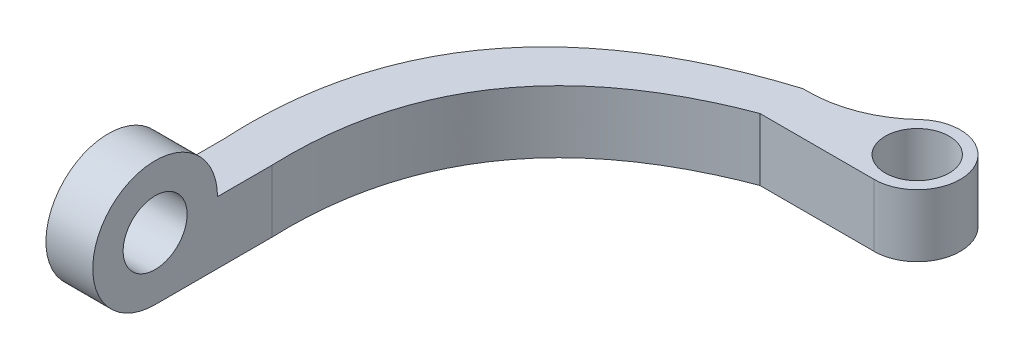
ISO-10303-21;
HEADER;
FILE_DESCRIPTION(('STEP AP214'),'2;1');
FILE_NAME('part.step','',(''),(''),'','','');
FILE_SCHEMA(('AUTOMOTIVE_DESIGN { 1 0 10303 214 1 1 1 1 }'));
ENDSEC;
DATA;
#1=APPLICATION_CONTEXT('core data for automotive mechanical design processes');
#2=APPLICATION_PROTOCOL_DEFINITION('international standard','automotive_design',2000,#1);
#3=PRODUCT_CONTEXT('',#1,'mechanical');
#4=PRODUCT('Part','Part','',(#3));
#5=PRODUCT_RELATED_PRODUCT_CATEGORY('part','',(#4));
#6=PRODUCT_DEFINITION_FORMATION('','',#4);
#7=PRODUCT_DEFINITION_CONTEXT('part definition',#1,'design');
#8=PRODUCT_DEFINITION('design','',#6,#7);
#9=PRODUCT_DEFINITION_SHAPE('','',#8);
#10=(LENGTH_UNIT() NAMED_UNIT(*) SI_UNIT(.MILLI.,.METRE.));
#11=(NAMED_UNIT(*) PLANE_ANGLE_UNIT() SI_UNIT($,.RADIAN.));
#12=(NAMED_UNIT(*) SI_UNIT($,.STERADIAN.) SOLID_ANGLE_UNIT());
#13=UNCERTAINTY_MEASURE_WITH_UNIT(LENGTH_MEASURE(1.E-05),#10,'distance_accuracy_value','');
#14=(GEOMETRIC_REPRESENTATION_CONTEXT(3) GLOBAL_UNCERTAINTY_ASSIGNED_CONTEXT((#13)) GLOBAL_UNIT_ASSIGNED_CONTEXT((#10,
#11,#12)) REPRESENTATION_CONTEXT('',''));
#15=CARTESIAN_POINT('',(0.,0.,0.));
#16=DIRECTION('',(0.,0.,1.));
#17=DIRECTION('',(1.,0.,0.));
#18=AXIS2_PLACEMENT_3D('',#15,#16,#17);
#19=CARTESIAN_POINT('',(-40.,8.,0.));
#20=DIRECTION('',(1.,0.,0.));
#21=DIRECTION('',(0.,0.,-1.));
#22=AXIS2_PLACEMENT_3D('',#19,#20,#21);
#23=PLANE('',#22);
#24=DIRECTION('',(0.,0.,1.));
#25=VECTOR('',#24,1.);
#26=CARTESIAN_POINT('',(-40.,0.,0.));
#27=LINE('',#26,#25);
#28=CARTESIAN_POINT('',(-40.,0.,-15.));
#29=VERTEX_POINT('',#28);
#30=CARTESIAN_POINT('',(-40.,0.,0.));
#31=VERTEX_POINT('',#30);
#32=EDGE_CURVE('E162',#29,#31,#27,.T.);
#33=ORIENTED_EDGE('',*,*,#32,.T.);
#34=CARTESIAN_POINT('',(-40.,8.,0.));
#35=DIRECTION('',(1.,0.,0.));
#36=DIRECTION('',(0.,0.,-1.));
#37=AXIS2_PLACEMENT_3D('',#34,#35,#36);
#38=CIRCLE('',#37,8.);
#39=CARTESIAN_POINT('',(-40.,8.,-8.));
#40=VERTEX_POINT('',#39);
#41=EDGE_CURVE('E113',#40,#31,#38,.T.);
#42=ORIENTED_EDGE('',*,*,#41,.F.);
#43=DIRECTION('',(0.,0.,1.));
#44=VECTOR('',#43,1.);
#45=CARTESIAN_POINT('',(-40.,8.,0.));
#46=LINE('',#45,#44);
#47=CARTESIAN_POINT('',(-40.,8.,-15.));
#48=VERTEX_POINT('',#47);
#49=EDGE_CURVE('E122',#48,#40,#46,.T.);
#50=ORIENTED_EDGE('',*,*,#49,.F.);
#51=DIRECTION('',(0.,-1.,0.));
#52=VECTOR('',#51,1.);
#53=CARTESIAN_POINT('',(-40.,8.,-15.));
#54=LINE('',#53,#52);
#55=EDGE_CURVE('E215',#48,#29,#54,.T.);
#56=ORIENTED_EDGE('',*,*,#55,.T.);
#57=EDGE_LOOP('',(#33,#42,#50,#56));
#58=FACE_BOUND('',#57,.T.);
#59=CARTESIAN_POINT('',(-40.,8.,0.));
#60=DIRECTION('',(1.,0.,0.));
#61=DIRECTION('',(0.,0.,-1.));
#62=AXIS2_PLACEMENT_3D('',#59,#60,#61);
#63=CIRCLE('',#62,4.1);
#64=CARTESIAN_POINT('',(-40.,8.,-4.1));
#65=VERTEX_POINT('',#64);
#66=EDGE_CURVE('E165',#65,#65,#63,.T.);
#67=ORIENTED_EDGE('',*,*,#66,.T.);
#68=EDGE_LOOP('',(#67));
#69=FACE_BOUND('',#68,.T.);
#70=ADVANCED_FACE('F33',(#58,#69),#23,.F.);
#71=CARTESIAN_POINT('',(-34.,8.,0.));
#72=DIRECTION('',(-1.,0.,0.));
#73=DIRECTION('',(0.,0.,1.));
#74=AXIS2_PLACEMENT_3D('',#71,#72,#73);
#75=PLANE('',#74);
#76=CARTESIAN_POINT('',(-34.,8.,0.));
#77=DIRECTION('',(1.,0.,0.));
#78=DIRECTION('',(0.,0.,-1.));
#79=AXIS2_PLACEMENT_3D('',#76,#77,#78);
#80=CIRCLE('',#79,8.);
#81=CARTESIAN_POINT('',(-34.,8.,-8.));
#82=VERTEX_POINT('',#81);
#83=CARTESIAN_POINT('',(-34.,0.,0.));
#84=VERTEX_POINT('',#83);
#85=EDGE_CURVE('E104',#82,#84,#80,.T.);
#86=ORIENTED_EDGE('',*,*,#85,.T.);
#87=DIRECTION('',(0.,0.,-1.));
#88=VECTOR('',#87,1.);
#89=CARTESIAN_POINT('',(-34.,0.,0.));
#90=LINE('',#89,#88);
#91=CARTESIAN_POINT('',(-34.,0.,-15.));
#92=VERTEX_POINT('',#91);
#93=EDGE_CURVE('E222',#84,#92,#90,.T.);
#94=ORIENTED_EDGE('',*,*,#93,.T.);
#95=DIRECTION('',(0.,-1.,0.));
#96=VECTOR('',#95,1.);
#97=CARTESIAN_POINT('',(-34.,8.,-15.));
#98=LINE('',#97,#96);
#99=CARTESIAN_POINT('',(-34.,8.,-15.));
#100=VERTEX_POINT('',#99);
#101=EDGE_CURVE('E128',#100,#92,#98,.T.);
#102=ORIENTED_EDGE('',*,*,#101,.F.);
#103=DIRECTION('',(0.,0.,-1.));
#104=VECTOR('',#103,1.);
#105=CARTESIAN_POINT('',(-34.,8.,0.));
#106=LINE('',#105,#104);
#107=EDGE_CURVE('E119',#82,#100,#106,.T.);
#108=ORIENTED_EDGE('',*,*,#107,.F.);
#109=EDGE_LOOP('',(#86,#94,#102,#108));
#110=FACE_BOUND('',#109,.T.);
#111=CARTESIAN_POINT('',(-34.,8.,0.));
#112=DIRECTION('',(1.,0.,0.));
#113=DIRECTION('',(0.,0.,-1.));
#114=AXIS2_PLACEMENT_3D('',#111,#112,#113);
#115=CIRCLE('',#114,4.1);
#116=CARTESIAN_POINT('',(-34.,8.,-4.1));
#117=VERTEX_POINT('',#116);
#118=EDGE_CURVE('E123',#117,#117,#115,.T.);
#119=ORIENTED_EDGE('',*,*,#118,.F.);
#120=EDGE_LOOP('',(#119));
#121=FACE_BOUND('',#120,.T.);
#122=ADVANCED_FACE('F125',(#110,#121),#75,.F.);
#123=CARTESIAN_POINT('',(-34.,8.,-15.));
#124=CARTESIAN_POINT('',(-35.0429524917305,8.,-42.0401779473099));
#125=CARTESIAN_POINT('',(-8.45509381388743,8.,-52.0129448419585));
#126=B_SPLINE_CURVE_WITH_KNOTS('',2,(#123,#124,#125),.UNSPECIFIED.,.F.,.F.,(3,3),(0.,1.),.UNSPECIFIED.);
#127=DIRECTION('',(0.,-1.,0.));
#128=VECTOR('',#127,1.);
#129=SURFACE_OF_LINEAR_EXTRUSION('',#126,#128);
#130=CARTESIAN_POINT('',(-34.,0.,-15.));
#131=CARTESIAN_POINT('',(-35.0429524917305,0.,-42.0401779473099));
#132=CARTESIAN_POINT('',(-8.45509381388743,0.,-52.0129448419585));
#133=B_SPLINE_CURVE_WITH_KNOTS('',2,(#130,#131,#132),.UNSPECIFIED.,.F.,.F.,(3,3),(0.,1.),.UNSPECIFIED.);
#134=CARTESIAN_POINT('',(-8.45509381388743,0.,-52.0129448419585));
#135=VERTEX_POINT('',#134);
#136=EDGE_CURVE('E224',#92,#135,#133,.T.);
#137=ORIENTED_EDGE('',*,*,#136,.T.);
#138=DIRECTION('',(0.,-1.,0.));
#139=VECTOR('',#138,1.);
#140=CARTESIAN_POINT('',(-8.45509381388743,8.,-52.0129448419585));
#141=LINE('',#140,#139);
#142=CARTESIAN_POINT('',(-8.45509381388743,8.,-52.0129448419585));
#143=VERTEX_POINT('',#142);
#144=EDGE_CURVE('E248',#143,#135,#141,.T.);
#145=ORIENTED_EDGE('',*,*,#144,.F.);
#146=EDGE_CURVE('E130',#100,#143,#126,.T.);
#147=ORIENTED_EDGE('',*,*,#146,.F.);
#148=ORIENTED_EDGE('',*,*,#101,.T.);
#149=EDGE_LOOP('',(#137,#145,#147,#148));
#150=FACE_BOUND('',#149,.T.);
#151=ADVANCED_FACE('F146',(#150),#129,.F.);
#152=CARTESIAN_POINT('',(-8.45509381388743,8.,-52.0129448419585));
#153=DIRECTION('',(0.,0.,-1.));
#154=DIRECTION('',(-1.,0.,0.));
#155=AXIS2_PLACEMENT_3D('',#152,#153,#154);
#156=PLANE('',#155);
#157=DIRECTION('',(1.,0.,0.));
#158=VECTOR('',#157,1.);
#159=CARTESIAN_POINT('',(-8.45509381388743,0.,-52.0129448419585));
#160=LINE('',#159,#158);
#161=CARTESIAN_POINT('',(6.19830878978078,0.,-52.0129448419585));
#162=VERTEX_POINT('',#161);
#163=EDGE_CURVE('E228',#135,#162,#160,.T.);
#164=ORIENTED_EDGE('',*,*,#163,.T.);
#165=DIRECTION('',(0.,-1.,0.));
#166=VECTOR('',#165,1.);
#167=CARTESIAN_POINT('',(6.19830878978078,8.,-52.0129448419585));
#168=LINE('',#167,#166);
#169=CARTESIAN_POINT('',(6.19830878978078,8.,-52.0129448419585));
#170=VERTEX_POINT('',#169);
#171=EDGE_CURVE('E245',#170,#162,#168,.T.);
#172=ORIENTED_EDGE('',*,*,#171,.F.);
#173=DIRECTION('',(1.,0.,0.));
#174=VECTOR('',#173,1.);
#175=CARTESIAN_POINT('',(-8.45509381388743,8.,-52.0129448419585));
#176=LINE('',#175,#174);
#177=EDGE_CURVE('E132',#143,#170,#176,.T.);
#178=ORIENTED_EDGE('',*,*,#177,.F.);
#179=ORIENTED_EDGE('',*,*,#144,.T.);
#180=EDGE_LOOP('',(#164,#172,#178,#179));
#181=FACE_BOUND('',#180,.T.);
#182=ADVANCED_FACE('F150',(#181),#156,.F.);
#183=CARTESIAN_POINT('',(-8.45509381388743,8.,-57.5284121761557));
#184=DIRECTION('',(0.,0.,1.));
#185=DIRECTION('',(1.,0.,0.));
#186=AXIS2_PLACEMENT_3D('',#183,#184,#185);
#187=PLANE('',#186);
#188=DIRECTION('',(-1.,0.,0.));
#189=VECTOR('',#188,1.);
#190=CARTESIAN_POINT('',(-8.45509381388743,8.,-57.5284121761557));
#191=LINE('',#190,#189);
#192=CARTESIAN_POINT('',(-7.79756202773229,8.,-57.5284121761557));
#193=VERTEX_POINT('',#192);
#194=CARTESIAN_POINT('',(-8.45509381388743,8.,-57.5284121761557));
#195=VERTEX_POINT('',#194);
#196=EDGE_CURVE('E216',#193,#195,#191,.T.);
#197=ORIENTED_EDGE('',*,*,#196,.F.);
#198=DIRECTION('',(0.,1.,0.));
#199=VECTOR('',#198,1.);
#200=CARTESIAN_POINT('',(-7.79756202773229,8.,-57.5284121761557));
#201=LINE('',#200,#199);
#202=CARTESIAN_POINT('',(-7.79756202773229,0.,-57.5284121761557));
#203=VERTEX_POINT('',#202);
#204=EDGE_CURVE('E252',#193,#203,#201,.F.);
#205=ORIENTED_EDGE('',*,*,#204,.T.);
#206=DIRECTION('',(-1.,0.,0.));
#207=VECTOR('',#206,1.);
#208=CARTESIAN_POINT('',(-8.45509381388743,0.,-57.5284121761557));
#209=LINE('',#208,#207);
#210=CARTESIAN_POINT('',(-8.45509381388743,0.,-57.5284121761557));
#211=VERTEX_POINT('',#210);
#212=EDGE_CURVE('E233',#203,#211,#209,.T.);
#213=ORIENTED_EDGE('',*,*,#212,.T.);
#214=DIRECTION('',(0.,-1.,0.));
#215=VECTOR('',#214,1.);
#216=CARTESIAN_POINT('',(-8.45509381388743,8.,-57.5284121761557));
#217=LINE('',#216,#215);
#218=EDGE_CURVE('E242',#195,#211,#217,.T.);
#219=ORIENTED_EDGE('',*,*,#218,.F.);
#220=EDGE_LOOP('',(#197,#205,#213,#219));
#221=FACE_BOUND('',#220,.T.);
#222=ADVANCED_FACE('F209',(#221),#187,.F.);
#223=CARTESIAN_POINT('',(-8.45509381388743,8.,-57.5284121761557));
#224=CARTESIAN_POINT('',(-41.8065009934501,8.,-47.1706314022594));
#225=CARTESIAN_POINT('',(-40.,8.,-15.));
#226=B_SPLINE_CURVE_WITH_KNOTS('',2,(#223,#224,#225),.UNSPECIFIED.,.F.,.F.,(3,3),(0.,1.),.UNSPECIFIED.);
#227=DIRECTION('',(0.,-1.,0.));
#228=VECTOR('',#227,1.);
#229=SURFACE_OF_LINEAR_EXTRUSION('',#226,#228);
#230=CARTESIAN_POINT('',(-8.45509381388743,0.,-57.5284121761557));
#231=CARTESIAN_POINT('',(-41.8065009934501,0.,-47.1706314022594));
#232=CARTESIAN_POINT('',(-40.,0.,-15.));
#233=B_SPLINE_CURVE_WITH_KNOTS('',2,(#230,#231,#232),.UNSPECIFIED.,.F.,.F.,(3,3),(0.,1.),.UNSPECIFIED.);
#234=EDGE_CURVE('E134',#211,#29,#233,.T.);
#235=ORIENTED_EDGE('',*,*,#234,.T.);
#236=ORIENTED_EDGE('',*,*,#55,.F.);
#237=EDGE_CURVE('E211',#195,#48,#226,.T.);
#238=ORIENTED_EDGE('',*,*,#237,.F.);
#239=ORIENTED_EDGE('',*,*,#218,.T.);
#240=EDGE_LOOP('',(#235,#236,#238,#239));
#241=FACE_BOUND('',#240,.T.);
#242=ADVANCED_FACE('F203',(#241),#229,.F.);
#243=CARTESIAN_POINT('',(-33.0170239501969,8.,-41.7174187451686));
#244=DIRECTION('',(0.,1.,0.));
#245=DIRECTION('',(0.,0.,1.));
#246=AXIS2_PLACEMENT_3D('',#243,#244,#245);
#247=PLANE('',#246);
#248=CARTESIAN_POINT('',(6.19830878978078,8.,-57.5284121761557));
#249=DIRECTION('',(0.,1.,0.));
#250=DIRECTION('',(0.,0.,1.));
#251=AXIS2_PLACEMENT_3D('',#248,#249,#250);
#252=CIRCLE('',#251,4.1);
#253=CARTESIAN_POINT('',(6.19830878978078,8.,-53.4284121761557));
#254=VERTEX_POINT('',#253);
#255=EDGE_CURVE('E176',#254,#254,#252,.T.);
#256=ORIENTED_EDGE('',*,*,#255,.F.);
#257=EDGE_LOOP('',(#256));
#258=FACE_BOUND('',#257,.T.);
#259=ORIENTED_EDGE('',*,*,#177,.T.);
#260=CARTESIAN_POINT('',(6.19830878978078,8.,-57.5284121761557));
#261=DIRECTION('',(0.,1.,0.));
#262=DIRECTION('',(0.,0.,1.));
#263=AXIS2_PLACEMENT_3D('',#260,#261,#262);
#264=CIRCLE('',#263,5.51546733419723);
#265=CARTESIAN_POINT('',(2.43559809690939,8.,-61.5610773192525));
#266=VERTEX_POINT('',#265);
#267=EDGE_CURVE('E172',#170,#266,#264,.T.);
#268=ORIENTED_EDGE('',*,*,#267,.T.);
#269=CARTESIAN_POINT('',(-7.79756202773229,8.,-72.5284121761557));
#270=DIRECTION('',(0.,1.,0.));
#271=DIRECTION('',(0.,0.,1.));
#272=AXIS2_PLACEMENT_3D('',#269,#270,#271);
#273=CIRCLE('',#272,15.);
#274=EDGE_CURVE('E11',#266,#193,#273,.F.);
#275=ORIENTED_EDGE('',*,*,#274,.T.);
#276=ORIENTED_EDGE('',*,*,#196,.T.);
#277=ORIENTED_EDGE('',*,*,#237,.T.);
#278=ORIENTED_EDGE('',*,*,#49,.T.);
#279=DIRECTION('',(1.,0.,0.));
#280=VECTOR('',#279,1.);
#281=CARTESIAN_POINT('',(-40.,8.,-8.));
#282=LINE('',#281,#280);
#283=EDGE_CURVE('E108',#82,#40,#282,.F.);
#284=ORIENTED_EDGE('',*,*,#283,.F.);
#285=ORIENTED_EDGE('',*,*,#107,.T.);
#286=ORIENTED_EDGE('',*,*,#146,.T.);
#287=EDGE_LOOP('',(#259,#268,#275,#276,#277,#278,#284,#285,#286));
#288=FACE_BOUND('',#287,.T.);
#289=ADVANCED_FACE('F118',(#258,#288),#247,.T.);
#290=CARTESIAN_POINT('',(-33.0170239501969,0.,-41.7174187451686));
#291=DIRECTION('',(0.,1.,0.));
#292=DIRECTION('',(0.,0.,1.));
#293=AXIS2_PLACEMENT_3D('',#290,#291,#292);
#294=PLANE('',#293);
#295=CARTESIAN_POINT('',(6.19830878978078,0.,-57.5284121761557));
#296=DIRECTION('',(0.,1.,0.));
#297=DIRECTION('',(0.,0.,1.));
#298=AXIS2_PLACEMENT_3D('',#295,#296,#297);
#299=CIRCLE('',#298,4.1);
#300=CARTESIAN_POINT('',(6.19830878978078,0.,-53.4284121761557));
#301=VERTEX_POINT('',#300);
#302=EDGE_CURVE('E174',#301,#301,#299,.T.);
#303=ORIENTED_EDGE('',*,*,#302,.T.);
#304=EDGE_LOOP('',(#303));
#305=FACE_BOUND('',#304,.T.);
#306=ORIENTED_EDGE('',*,*,#212,.F.);
#307=CARTESIAN_POINT('',(-7.79756202773229,0.,-72.5284121761557));
#308=DIRECTION('',(0.,1.,0.));
#309=DIRECTION('',(0.,0.,1.));
#310=AXIS2_PLACEMENT_3D('',#307,#308,#309);
#311=CIRCLE('',#310,15.);
#312=CARTESIAN_POINT('',(2.43559809690939,0.,-61.5610773192525));
#313=VERTEX_POINT('',#312);
#314=EDGE_CURVE('E41',#203,#313,#311,.T.);
#315=ORIENTED_EDGE('',*,*,#314,.T.);
#316=CARTESIAN_POINT('',(6.19830878978078,0.,-57.5284121761557));
#317=DIRECTION('',(0.,1.,0.));
#318=DIRECTION('',(0.,0.,1.));
#319=AXIS2_PLACEMENT_3D('',#316,#317,#318);
#320=CIRCLE('',#319,5.51546733419723);
#321=EDGE_CURVE('E114',#162,#313,#320,.T.);
#322=ORIENTED_EDGE('',*,*,#321,.F.);
#323=ORIENTED_EDGE('',*,*,#163,.F.);
#324=ORIENTED_EDGE('',*,*,#136,.F.);
#325=ORIENTED_EDGE('',*,*,#93,.F.);
#326=DIRECTION('',(1.,0.,0.));
#327=VECTOR('',#326,1.);
#328=CARTESIAN_POINT('',(-40.,0.,0.));
#329=LINE('',#328,#327);
#330=EDGE_CURVE('E110',#31,#84,#329,.T.);
#331=ORIENTED_EDGE('',*,*,#330,.F.);
#332=ORIENTED_EDGE('',*,*,#32,.F.);
#333=ORIENTED_EDGE('',*,*,#234,.F.);
#334=EDGE_LOOP('',(#306,#315,#322,#323,#324,#325,#331,#332,#333));
#335=FACE_BOUND('',#334,.T.);
#336=ADVANCED_FACE('F182',(#305,#335),#294,.F.);
#337=CARTESIAN_POINT('',(-42.,8.,0.));
#338=DIRECTION('',(1.,0.,0.));
#339=DIRECTION('',(0.,0.,-1.));
#340=AXIS2_PLACEMENT_3D('',#337,#338,#339);
#341=CYLINDRICAL_SURFACE('',#340,4.1);
#342=ORIENTED_EDGE('',*,*,#66,.F.);
#343=EDGE_LOOP('',(#342));
#344=FACE_BOUND('',#343,.T.);
#345=ORIENTED_EDGE('',*,*,#118,.T.);
#346=EDGE_LOOP('',(#345));
#347=FACE_BOUND('',#346,.T.);
#348=ADVANCED_FACE('F198',(#344,#347),#341,.F.);
#349=CARTESIAN_POINT('',(-40.,8.,0.));
#350=DIRECTION('',(1.,0.,0.));
#351=DIRECTION('',(0.,0.,-1.));
#352=AXIS2_PLACEMENT_3D('',#349,#350,#351);
#353=CYLINDRICAL_SURFACE('',#352,8.);
#354=ORIENTED_EDGE('',*,*,#85,.F.);
#355=ORIENTED_EDGE('',*,*,#283,.T.);
#356=ORIENTED_EDGE('',*,*,#41,.T.);
#357=ORIENTED_EDGE('',*,*,#330,.T.);
#358=EDGE_LOOP('',(#354,#355,#356,#357));
#359=FACE_BOUND('',#358,.T.);
#360=ADVANCED_FACE('F106',(#359),#353,.T.);
#361=CARTESIAN_POINT('',(6.19830878978078,0.,-57.5284121761557));
#362=DIRECTION('',(0.,1.,0.));
#363=DIRECTION('',(0.,0.,1.));
#364=AXIS2_PLACEMENT_3D('',#361,#362,#363);
#365=CYLINDRICAL_SURFACE('',#364,5.51546733419723);
#366=ORIENTED_EDGE('',*,*,#321,.T.);
#367=DIRECTION('',(0.,1.,0.));
#368=VECTOR('',#367,1.);
#369=CARTESIAN_POINT('',(2.43559809690939,0.,-61.5610773192525));
#370=LINE('',#369,#368);
#371=EDGE_CURVE('E48',#313,#266,#370,.T.);
#372=ORIENTED_EDGE('',*,*,#371,.T.);
#373=ORIENTED_EDGE('',*,*,#267,.F.);
#374=ORIENTED_EDGE('',*,*,#171,.T.);
#375=EDGE_LOOP('',(#366,#372,#373,#374));
#376=FACE_BOUND('',#375,.T.);
#377=ADVANCED_FACE('F186',(#376),#365,.T.);
#378=CARTESIAN_POINT('',(6.19830878978078,0.,-57.5284121761557));
#379=DIRECTION('',(0.,1.,0.));
#380=DIRECTION('',(0.,0.,1.));
#381=AXIS2_PLACEMENT_3D('',#378,#379,#380);
#382=CYLINDRICAL_SURFACE('',#381,4.1);
#383=ORIENTED_EDGE('',*,*,#255,.T.);
#384=EDGE_LOOP('',(#383));
#385=FACE_BOUND('',#384,.T.);
#386=ORIENTED_EDGE('',*,*,#302,.F.);
#387=EDGE_LOOP('',(#386));
#388=FACE_BOUND('',#387,.T.);
#389=ADVANCED_FACE('F184',(#385,#388),#382,.F.);
#390=CARTESIAN_POINT('',(-7.79756202773229,0.,-72.5284121761557));
#391=DIRECTION('',(0.,1.,0.));
#392=DIRECTION('',(0.,0.,1.));
#393=AXIS2_PLACEMENT_3D('',#390,#391,#392);
#394=CYLINDRICAL_SURFACE('',#393,15.);
#395=ORIENTED_EDGE('',*,*,#274,.F.);
#396=ORIENTED_EDGE('',*,*,#371,.F.);
#397=ORIENTED_EDGE('',*,*,#314,.F.);
#398=ORIENTED_EDGE('',*,*,#204,.F.);
#399=EDGE_LOOP('',(#395,#396,#397,#398));
#400=FACE_BOUND('',#399,.T.);
#401=ADVANCED_FACE('F35',(#400),#394,.F.);
#402=CLOSED_SHELL('',(#70,#122,#151,#182,#222,#242,#289,#336,#348,#360,#377,#389,#401));
#403=MANIFOLD_SOLID_BREP('B2',#402);
#404=ADVANCED_BREP_SHAPE_REPRESENTATION('',(#18,#403),#14);
#405=SHAPE_DEFINITION_REPRESENTATION(#9,#404);
ENDSEC;
END-ISO-10303-21;
